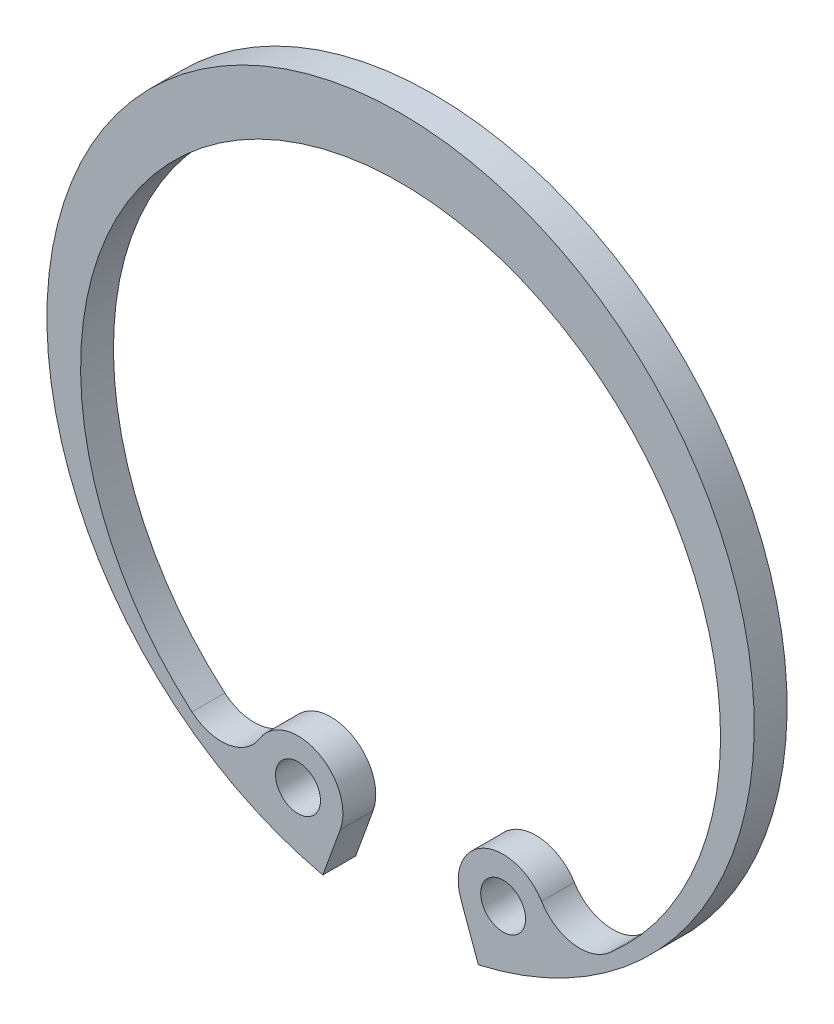
ISO-10303-21;
HEADER;
FILE_DESCRIPTION(('STEP AP214'),'2;1');
FILE_NAME('part.step','',(''),(''),'','','');
FILE_SCHEMA(('AUTOMOTIVE_DESIGN { 1 0 10303 214 1 1 1 1 }'));
ENDSEC;
DATA;
#1=APPLICATION_CONTEXT('core data for automotive mechanical design processes');
#2=APPLICATION_PROTOCOL_DEFINITION('international standard','automotive_design',2000,#1);
#3=PRODUCT_CONTEXT('',#1,'mechanical');
#4=PRODUCT('Part','Part','',(#3));
#5=PRODUCT_RELATED_PRODUCT_CATEGORY('part','',(#4));
#6=PRODUCT_DEFINITION_FORMATION('','',#4);
#7=PRODUCT_DEFINITION_CONTEXT('part definition',#1,'design');
#8=PRODUCT_DEFINITION('design','',#6,#7);
#9=PRODUCT_DEFINITION_SHAPE('','',#8);
#10=(LENGTH_UNIT() NAMED_UNIT(*) SI_UNIT(.MILLI.,.METRE.));
#11=(NAMED_UNIT(*) PLANE_ANGLE_UNIT() SI_UNIT($,.RADIAN.));
#12=(NAMED_UNIT(*) SI_UNIT($,.STERADIAN.) SOLID_ANGLE_UNIT());
#13=UNCERTAINTY_MEASURE_WITH_UNIT(LENGTH_MEASURE(1.E-05),#10,'distance_accuracy_value','');
#14=(GEOMETRIC_REPRESENTATION_CONTEXT(3) GLOBAL_UNCERTAINTY_ASSIGNED_CONTEXT((#13)) GLOBAL_UNIT_ASSIGNED_CONTEXT((#10,
#11,#12)) REPRESENTATION_CONTEXT('',''));
#15=CARTESIAN_POINT('',(0.,0.,0.));
#16=DIRECTION('',(0.,0.,1.));
#17=DIRECTION('',(1.,0.,0.));
#18=AXIS2_PLACEMENT_3D('',#15,#16,#17);
#19=CARTESIAN_POINT('',(0.,0.,0.975));
#20=DIRECTION('',(0.,0.,-1.));
#21=DIRECTION('',(-1.,0.,0.));
#22=AXIS2_PLACEMENT_3D('',#19,#20,#21);
#23=PLANE('',#22);
#24=CARTESIAN_POINT('',(-5.32360078088962,-6.98043795968956,0.975));
#25=DIRECTION('',(0.,0.,-1.));
#26=DIRECTION('',(-1.,0.,0.));
#27=AXIS2_PLACEMENT_3D('',#24,#25,#26);
#28=CIRCLE('',#27,1.33333333333333);
#29=CARTESIAN_POINT('',(-6.19276009205528,-7.99154619800622,0.975));
#30=VERTEX_POINT('',#29);
#31=CARTESIAN_POINT('',(-4.18415582842588,-7.67285617008171,0.975));
#32=VERTEX_POINT('',#31);
#33=EDGE_CURVE('E140',#30,#32,#28,.F.);
#34=ORIENTED_EDGE('',*,*,#33,.T.);
#35=CARTESIAN_POINT('',(-3.04471087596214,-8.36527438047387,0.975));
#36=DIRECTION('',(0.,0.,-1.));
#37=DIRECTION('',(-1.,0.,0.));
#38=AXIS2_PLACEMENT_3D('',#35,#36,#37);
#39=CIRCLE('',#38,1.33333333333333);
#40=CARTESIAN_POINT('',(-1.79178738158093,-8.82130123824143,0.975));
#41=VERTEX_POINT('',#40);
#42=EDGE_CURVE('E96',#41,#32,#39,.F.);
#43=ORIENTED_EDGE('',*,*,#42,.F.);
#44=DIRECTION('',(-0.34202014332567,-0.939692620785908,0.));
#45=VECTOR('',#44,1.);
#46=CARTESIAN_POINT('',(-1.79178738158093,-8.82130123824143,0.975));
#47=LINE('',#46,#45);
#48=CARTESIAN_POINT('',(-2.30921625274565,-10.2429253779404,0.975));
#49=VERTEX_POINT('',#48);
#50=EDGE_CURVE('E93',#41,#49,#47,.T.);
#51=ORIENTED_EDGE('',*,*,#50,.T.);
#52=CARTESIAN_POINT('',(0.,0.,0.975));
#53=DIRECTION('',(0.,0.,-1.));
#54=DIRECTION('',(-1.,0.,0.));
#55=AXIS2_PLACEMENT_3D('',#52,#53,#54);
#56=CIRCLE('',#55,10.5);
#57=CARTESIAN_POINT('',(2.30921625274565,-10.2429253779404,0.975));
#58=VERTEX_POINT('',#57);
#59=EDGE_CURVE('E81',#58,#49,#56,.F.);
#60=ORIENTED_EDGE('',*,*,#59,.F.);
#61=DIRECTION('',(-0.34202014332567,0.939692620785908,0.));
#62=VECTOR('',#61,1.);
#63=CARTESIAN_POINT('',(1.79178738158093,-8.82130123824143,0.975));
#64=LINE('',#63,#62);
#65=CARTESIAN_POINT('',(1.79178738158093,-8.82130123824143,0.975));
#66=VERTEX_POINT('',#65);
#67=EDGE_CURVE('E108',#58,#66,#64,.T.);
#68=ORIENTED_EDGE('',*,*,#67,.T.);
#69=CARTESIAN_POINT('',(3.04471087596214,-8.36527438047387,0.975));
#70=DIRECTION('',(0.,0.,-1.));
#71=DIRECTION('',(-1.,0.,0.));
#72=AXIS2_PLACEMENT_3D('',#69,#70,#71);
#73=CIRCLE('',#72,1.33333333333333);
#74=CARTESIAN_POINT('',(4.18415582842588,-7.67285617008171,0.975));
#75=VERTEX_POINT('',#74);
#76=EDGE_CURVE('E129',#75,#66,#73,.F.);
#77=ORIENTED_EDGE('',*,*,#76,.F.);
#78=CARTESIAN_POINT('',(5.32360078088962,-6.98043795968956,0.975));
#79=DIRECTION('',(0.,0.,-1.));
#80=DIRECTION('',(-1.,0.,0.));
#81=AXIS2_PLACEMENT_3D('',#78,#79,#80);
#82=CIRCLE('',#81,1.33333333333333);
#83=CARTESIAN_POINT('',(6.19276009205528,-7.99154619800622,0.975));
#84=VERTEX_POINT('',#83);
#85=EDGE_CURVE('E133',#75,#84,#82,.F.);
#86=ORIENTED_EDGE('',*,*,#85,.T.);
#87=CARTESIAN_POINT('',(0.,-0.7874,0.975));
#88=DIRECTION('',(0.,0.,-1.));
#89=DIRECTION('',(-1.,0.,0.));
#90=AXIS2_PLACEMENT_3D('',#87,#88,#89);
#91=CIRCLE('',#90,9.5);
#92=EDGE_CURVE('E137',#84,#30,#91,.F.);
#93=ORIENTED_EDGE('',*,*,#92,.T.);
#94=EDGE_LOOP('',(#34,#43,#51,#60,#68,#77,#86,#93));
#95=FACE_BOUND('',#94,.T.);
#96=CARTESIAN_POINT('',(3.04471087596214,-8.36527438047387,0.975));
#97=DIRECTION('',(0.,0.,-1.));
#98=DIRECTION('',(-1.,0.,0.));
#99=AXIS2_PLACEMENT_3D('',#96,#97,#98);
#100=CIRCLE('',#99,0.666666666666667);
#101=CARTESIAN_POINT('',(2.37804420929547,-8.36527438047387,0.975));
#102=VERTEX_POINT('',#101);
#103=EDGE_CURVE('E20',#102,#102,#100,.F.);
#104=ORIENTED_EDGE('',*,*,#103,.T.);
#105=EDGE_LOOP('',(#104));
#106=FACE_BOUND('',#105,.T.);
#107=CARTESIAN_POINT('',(-3.04471087596214,-8.36527438047387,0.975));
#108=DIRECTION('',(0.,0.,-1.));
#109=DIRECTION('',(-1.,0.,0.));
#110=AXIS2_PLACEMENT_3D('',#107,#108,#109);
#111=CIRCLE('',#110,0.666666666666667);
#112=CARTESIAN_POINT('',(-3.71137754262881,-8.36527438047387,0.975));
#113=VERTEX_POINT('',#112);
#114=EDGE_CURVE('E109',#113,#113,#111,.F.);
#115=ORIENTED_EDGE('',*,*,#114,.T.);
#116=EDGE_LOOP('',(#115));
#117=FACE_BOUND('',#116,.T.);
#118=ADVANCED_FACE('F17',(#95,#106,#117),#23,.T.);
#119=CARTESIAN_POINT('',(3.04471087596214,-8.36527438047387,1.95));
#120=DIRECTION('',(0.,0.,-1.));
#121=DIRECTION('',(-1.,0.,0.));
#122=AXIS2_PLACEMENT_3D('',#119,#120,#121);
#123=CYLINDRICAL_SURFACE('',#122,0.666666666666667);
#124=CARTESIAN_POINT('',(3.04471087596214,-8.36527438047387,1.95));
#125=DIRECTION('',(0.,0.,-1.));
#126=DIRECTION('',(-1.,0.,0.));
#127=AXIS2_PLACEMENT_3D('',#124,#125,#126);
#128=CIRCLE('',#127,0.666666666666667);
#129=CARTESIAN_POINT('',(2.37804420929547,-8.36527438047387,1.95));
#130=VERTEX_POINT('',#129);
#131=EDGE_CURVE('E124',#130,#130,#128,.T.);
#132=ORIENTED_EDGE('',*,*,#131,.F.);
#133=EDGE_LOOP('',(#132));
#134=FACE_BOUND('',#133,.T.);
#135=ORIENTED_EDGE('',*,*,#103,.F.);
#136=EDGE_LOOP('',(#135));
#137=FACE_BOUND('',#136,.T.);
#138=ADVANCED_FACE('F265',(#134,#137),#123,.F.);
#139=CARTESIAN_POINT('',(0.,0.,0.975));
#140=DIRECTION('',(0.,0.,-1.));
#141=DIRECTION('',(-1.,0.,0.));
#142=AXIS2_PLACEMENT_3D('',#139,#140,#141);
#143=CYLINDRICAL_SURFACE('',#142,10.5);
#144=ORIENTED_EDGE('',*,*,#59,.T.);
#145=DIRECTION('',(0.,0.,1.));
#146=VECTOR('',#145,1.);
#147=CARTESIAN_POINT('',(-2.30921625274565,-10.2429253779404,1.95));
#148=LINE('',#147,#146);
#149=CARTESIAN_POINT('',(-2.30921625274565,-10.2429253779404,1.95));
#150=VERTEX_POINT('',#149);
#151=EDGE_CURVE('E85',#49,#150,#148,.T.);
#152=ORIENTED_EDGE('',*,*,#151,.T.);
#153=CARTESIAN_POINT('',(0.,0.,1.95));
#154=DIRECTION('',(0.,0.,-1.));
#155=DIRECTION('',(-1.,0.,0.));
#156=AXIS2_PLACEMENT_3D('',#153,#154,#155);
#157=CIRCLE('',#156,10.5);
#158=CARTESIAN_POINT('',(2.30921625274565,-10.2429253779404,1.95));
#159=VERTEX_POINT('',#158);
#160=EDGE_CURVE('E122',#159,#150,#157,.F.);
#161=ORIENTED_EDGE('',*,*,#160,.F.);
#162=DIRECTION('',(0.,0.,1.));
#163=VECTOR('',#162,1.);
#164=CARTESIAN_POINT('',(2.30921625274565,-10.2429253779404,1.95));
#165=LINE('',#164,#163);
#166=EDGE_CURVE('E88',#159,#58,#165,.F.);
#167=ORIENTED_EDGE('',*,*,#166,.T.);
#168=EDGE_LOOP('',(#144,#152,#161,#167));
#169=FACE_BOUND('',#168,.T.);
#170=ADVANCED_FACE('F83',(#169),#143,.T.);
#171=CARTESIAN_POINT('',(-1.79178738158093,-8.82130123824143,1.95));
#172=DIRECTION('',(-0.939692620785908,0.34202014332567,0.));
#173=DIRECTION('',(-0.34202014332567,-0.939692620785908,0.));
#174=AXIS2_PLACEMENT_3D('',#171,#172,#173);
#175=PLANE('',#174);
#176=DIRECTION('',(0.,0.,-1.));
#177=VECTOR('',#176,1.);
#178=CARTESIAN_POINT('',(-1.79178738158093,-8.82130123824143,1.95));
#179=LINE('',#178,#177);
#180=CARTESIAN_POINT('',(-1.79178738158093,-8.82130123824143,1.95));
#181=VERTEX_POINT('',#180);
#182=EDGE_CURVE('E106',#181,#41,#179,.T.);
#183=ORIENTED_EDGE('',*,*,#182,.F.);
#184=DIRECTION('',(0.34202014332567,0.939692620785908,0.));
#185=VECTOR('',#184,1.);
#186=CARTESIAN_POINT('',(-2.30921625274565,-10.2429253779404,1.95));
#187=LINE('',#186,#185);
#188=EDGE_CURVE('E102',#150,#181,#187,.T.);
#189=ORIENTED_EDGE('',*,*,#188,.F.);
#190=ORIENTED_EDGE('',*,*,#151,.F.);
#191=ORIENTED_EDGE('',*,*,#50,.F.);
#192=EDGE_LOOP('',(#183,#189,#190,#191));
#193=FACE_BOUND('',#192,.T.);
#194=ADVANCED_FACE('F100',(#193),#175,.F.);
#195=CARTESIAN_POINT('',(-3.04471087596214,-8.36527438047387,1.95));
#196=DIRECTION('',(0.,0.,-1.));
#197=DIRECTION('',(-1.,0.,0.));
#198=AXIS2_PLACEMENT_3D('',#195,#196,#197);
#199=CYLINDRICAL_SURFACE('',#198,1.33333333333333);
#200=CARTESIAN_POINT('',(-3.04471087596214,-8.36527438047387,1.95));
#201=DIRECTION('',(0.,0.,-1.));
#202=DIRECTION('',(-1.,0.,0.));
#203=AXIS2_PLACEMENT_3D('',#200,#201,#202);
#204=CIRCLE('',#203,1.33333333333333);
#205=CARTESIAN_POINT('',(-4.18415582842588,-7.67285617008171,1.95));
#206=VERTEX_POINT('',#205);
#207=EDGE_CURVE('E119',#181,#206,#204,.F.);
#208=ORIENTED_EDGE('',*,*,#207,.F.);
#209=ORIENTED_EDGE('',*,*,#182,.T.);
#210=ORIENTED_EDGE('',*,*,#42,.T.);
#211=DIRECTION('',(0.,0.,-1.));
#212=VECTOR('',#211,1.);
#213=CARTESIAN_POINT('',(-4.18415582842588,-7.67285617008171,1.95));
#214=LINE('',#213,#212);
#215=EDGE_CURVE('E142',#32,#206,#214,.F.);
#216=ORIENTED_EDGE('',*,*,#215,.T.);
#217=EDGE_LOOP('',(#208,#209,#210,#216));
#218=FACE_BOUND('',#217,.T.);
#219=ADVANCED_FACE('F176',(#218),#199,.T.);
#220=CARTESIAN_POINT('',(-5.32360078088962,-6.98043795968956,1.95));
#221=DIRECTION('',(0.,0.,-1.));
#222=DIRECTION('',(-1.,0.,0.));
#223=AXIS2_PLACEMENT_3D('',#220,#221,#222);
#224=CYLINDRICAL_SURFACE('',#223,1.33333333333333);
#225=DIRECTION('',(0.,0.,-1.));
#226=VECTOR('',#225,1.);
#227=CARTESIAN_POINT('',(-6.19276009205527,-7.99154619800622,1.95));
#228=LINE('',#227,#226);
#229=CARTESIAN_POINT('',(-6.19276009205528,-7.99154619800622,1.95));
#230=VERTEX_POINT('',#229);
#231=EDGE_CURVE('E139',#30,#230,#228,.F.);
#232=ORIENTED_EDGE('',*,*,#231,.T.);
#233=CARTESIAN_POINT('',(-5.32360078088962,-6.98043795968956,1.95));
#234=DIRECTION('',(0.,0.,-1.));
#235=DIRECTION('',(-1.,0.,0.));
#236=AXIS2_PLACEMENT_3D('',#233,#234,#235);
#237=CIRCLE('',#236,1.33333333333333);
#238=EDGE_CURVE('E116',#206,#230,#237,.T.);
#239=ORIENTED_EDGE('',*,*,#238,.F.);
#240=ORIENTED_EDGE('',*,*,#215,.F.);
#241=ORIENTED_EDGE('',*,*,#33,.F.);
#242=EDGE_LOOP('',(#232,#239,#240,#241));
#243=FACE_BOUND('',#242,.T.);
#244=ADVANCED_FACE('F175',(#243),#224,.F.);
#245=CARTESIAN_POINT('',(0.,-0.7874,1.95));
#246=DIRECTION('',(0.,0.,-1.));
#247=DIRECTION('',(-1.,0.,0.));
#248=AXIS2_PLACEMENT_3D('',#245,#246,#247);
#249=CYLINDRICAL_SURFACE('',#248,9.5);
#250=DIRECTION('',(0.,0.,-1.));
#251=VECTOR('',#250,1.);
#252=CARTESIAN_POINT('',(6.19276009205528,-7.99154619800622,1.95));
#253=LINE('',#252,#251);
#254=CARTESIAN_POINT('',(6.19276009205528,-7.99154619800622,1.95));
#255=VERTEX_POINT('',#254);
#256=EDGE_CURVE('E136',#84,#255,#253,.F.);
#257=ORIENTED_EDGE('',*,*,#256,.T.);
#258=CARTESIAN_POINT('',(0.,-0.7874,1.95));
#259=DIRECTION('',(0.,0.,-1.));
#260=DIRECTION('',(-1.,0.,0.));
#261=AXIS2_PLACEMENT_3D('',#258,#259,#260);
#262=CIRCLE('',#261,9.5);
#263=EDGE_CURVE('E114',#230,#255,#262,.T.);
#264=ORIENTED_EDGE('',*,*,#263,.F.);
#265=ORIENTED_EDGE('',*,*,#231,.F.);
#266=ORIENTED_EDGE('',*,*,#92,.F.);
#267=EDGE_LOOP('',(#257,#264,#265,#266));
#268=FACE_BOUND('',#267,.T.);
#269=ADVANCED_FACE('F172',(#268),#249,.F.);
#270=CARTESIAN_POINT('',(5.32360078088962,-6.98043795968956,1.95));
#271=DIRECTION('',(0.,0.,-1.));
#272=DIRECTION('',(-1.,0.,0.));
#273=AXIS2_PLACEMENT_3D('',#270,#271,#272);
#274=CYLINDRICAL_SURFACE('',#273,1.33333333333333);
#275=DIRECTION('',(0.,0.,-1.));
#276=VECTOR('',#275,1.);
#277=CARTESIAN_POINT('',(4.18415582842588,-7.67285617008171,1.95));
#278=LINE('',#277,#276);
#279=CARTESIAN_POINT('',(4.18415582842588,-7.67285617008171,1.95));
#280=VERTEX_POINT('',#279);
#281=EDGE_CURVE('E132',#280,#75,#278,.T.);
#282=ORIENTED_EDGE('',*,*,#281,.F.);
#283=CARTESIAN_POINT('',(5.32360078088962,-6.98043795968956,1.95));
#284=DIRECTION('',(0.,0.,-1.));
#285=DIRECTION('',(-1.,0.,0.));
#286=AXIS2_PLACEMENT_3D('',#283,#284,#285);
#287=CIRCLE('',#286,1.33333333333333);
#288=EDGE_CURVE('E112',#255,#280,#287,.T.);
#289=ORIENTED_EDGE('',*,*,#288,.F.);
#290=ORIENTED_EDGE('',*,*,#256,.F.);
#291=ORIENTED_EDGE('',*,*,#85,.F.);
#292=EDGE_LOOP('',(#282,#289,#290,#291));
#293=FACE_BOUND('',#292,.T.);
#294=ADVANCED_FACE('F166',(#293),#274,.F.);
#295=CARTESIAN_POINT('',(3.04471087596214,-8.36527438047387,1.95));
#296=DIRECTION('',(0.,0.,-1.));
#297=DIRECTION('',(-1.,0.,0.));
#298=AXIS2_PLACEMENT_3D('',#295,#296,#297);
#299=CYLINDRICAL_SURFACE('',#298,1.33333333333333);
#300=ORIENTED_EDGE('',*,*,#76,.T.);
#301=DIRECTION('',(0.,0.,1.));
#302=VECTOR('',#301,1.);
#303=CARTESIAN_POINT('',(1.79178738158093,-8.82130123824143,1.95));
#304=LINE('',#303,#302);
#305=CARTESIAN_POINT('',(1.79178738158093,-8.82130123824143,1.95));
#306=VERTEX_POINT('',#305);
#307=EDGE_CURVE('E131',#66,#306,#304,.T.);
#308=ORIENTED_EDGE('',*,*,#307,.T.);
#309=CARTESIAN_POINT('',(3.04471087596214,-8.36527438047387,1.95));
#310=DIRECTION('',(0.,0.,-1.));
#311=DIRECTION('',(-1.,0.,0.));
#312=AXIS2_PLACEMENT_3D('',#309,#310,#311);
#313=CIRCLE('',#312,1.33333333333333);
#314=EDGE_CURVE('E35',#280,#306,#313,.F.);
#315=ORIENTED_EDGE('',*,*,#314,.F.);
#316=ORIENTED_EDGE('',*,*,#281,.T.);
#317=EDGE_LOOP('',(#300,#308,#315,#316));
#318=FACE_BOUND('',#317,.T.);
#319=ADVANCED_FACE('F168',(#318),#299,.T.);
#320=CARTESIAN_POINT('',(1.79178738158093,-8.82130123824143,1.95));
#321=DIRECTION('',(0.939692620785908,0.34202014332567,0.));
#322=DIRECTION('',(-0.34202014332567,0.939692620785908,0.));
#323=AXIS2_PLACEMENT_3D('',#320,#321,#322);
#324=PLANE('',#323);
#325=ORIENTED_EDGE('',*,*,#166,.F.);
#326=DIRECTION('',(0.34202014332567,-0.939692620785908,0.));
#327=VECTOR('',#326,1.);
#328=CARTESIAN_POINT('',(1.79178738158093,-8.82130123824143,1.95));
#329=LINE('',#328,#327);
#330=EDGE_CURVE('E26',#306,#159,#329,.T.);
#331=ORIENTED_EDGE('',*,*,#330,.F.);
#332=ORIENTED_EDGE('',*,*,#307,.F.);
#333=ORIENTED_EDGE('',*,*,#67,.F.);
#334=EDGE_LOOP('',(#325,#331,#332,#333));
#335=FACE_BOUND('',#334,.T.);
#336=ADVANCED_FACE('F161',(#335),#324,.F.);
#337=CARTESIAN_POINT('',(-3.04471087596214,-8.36527438047387,1.95));
#338=DIRECTION('',(0.,0.,-1.));
#339=DIRECTION('',(-1.,0.,0.));
#340=AXIS2_PLACEMENT_3D('',#337,#338,#339);
#341=CYLINDRICAL_SURFACE('',#340,0.666666666666667);
#342=CARTESIAN_POINT('',(-3.04471087596214,-8.36527438047387,1.95));
#343=DIRECTION('',(0.,0.,-1.));
#344=DIRECTION('',(-1.,0.,0.));
#345=AXIS2_PLACEMENT_3D('',#342,#343,#344);
#346=CIRCLE('',#345,0.666666666666667);
#347=CARTESIAN_POINT('',(-3.71137754262881,-8.36527438047387,1.95));
#348=VERTEX_POINT('',#347);
#349=EDGE_CURVE('E11',#348,#348,#346,.T.);
#350=ORIENTED_EDGE('',*,*,#349,.F.);
#351=EDGE_LOOP('',(#350));
#352=FACE_BOUND('',#351,.T.);
#353=ORIENTED_EDGE('',*,*,#114,.F.);
#354=EDGE_LOOP('',(#353));
#355=FACE_BOUND('',#354,.T.);
#356=ADVANCED_FACE('F187',(#352,#355),#341,.F.);
#357=CARTESIAN_POINT('',(0.,0.,1.95));
#358=DIRECTION('',(0.,0.,1.));
#359=DIRECTION('',(1.,0.,0.));
#360=AXIS2_PLACEMENT_3D('',#357,#358,#359);
#361=PLANE('',#360);
#362=ORIENTED_EDGE('',*,*,#349,.T.);
#363=EDGE_LOOP('',(#362));
#364=FACE_BOUND('',#363,.T.);
#365=ORIENTED_EDGE('',*,*,#314,.T.);
#366=ORIENTED_EDGE('',*,*,#330,.T.);
#367=ORIENTED_EDGE('',*,*,#160,.T.);
#368=ORIENTED_EDGE('',*,*,#188,.T.);
#369=ORIENTED_EDGE('',*,*,#207,.T.);
#370=ORIENTED_EDGE('',*,*,#238,.T.);
#371=ORIENTED_EDGE('',*,*,#263,.T.);
#372=ORIENTED_EDGE('',*,*,#288,.T.);
#373=EDGE_LOOP('',(#365,#366,#367,#368,#369,#370,#371,#372));
#374=FACE_BOUND('',#373,.T.);
#375=ORIENTED_EDGE('',*,*,#131,.T.);
#376=EDGE_LOOP('',(#375));
#377=FACE_BOUND('',#376,.T.);
#378=ADVANCED_FACE('F157',(#364,#374,#377),#361,.T.);
#379=CLOSED_SHELL('',(#118,#138,#170,#194,#219,#244,#269,#294,#319,#336,#356,#378));
#380=MANIFOLD_SOLID_BREP('B1',#379);
#381=ADVANCED_BREP_SHAPE_REPRESENTATION('',(#18,#380),#14);
#382=SHAPE_DEFINITION_REPRESENTATION(#9,#381);
ENDSEC;
END-ISO-10303-21;
